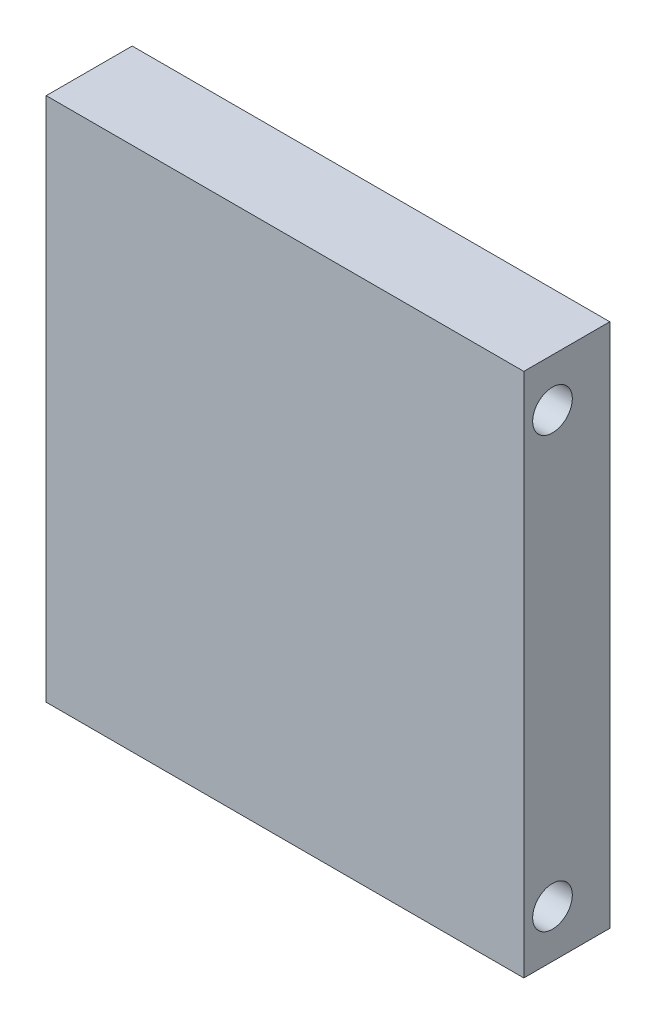
ISO-10303-21;
HEADER;
FILE_DESCRIPTION(('STEP AP214'),'2;1');
FILE_NAME('part.step','',(''),(''),'','','');
FILE_SCHEMA(('AUTOMOTIVE_DESIGN { 1 0 10303 214 1 1 1 1 }'));
ENDSEC;
DATA;
#1=APPLICATION_CONTEXT('core data for automotive mechanical design processes');
#2=APPLICATION_PROTOCOL_DEFINITION('international standard','automotive_design',2000,#1);
#3=PRODUCT_CONTEXT('',#1,'mechanical');
#4=PRODUCT('Part','Part','',(#3));
#5=PRODUCT_RELATED_PRODUCT_CATEGORY('part','',(#4));
#6=PRODUCT_DEFINITION_FORMATION('','',#4);
#7=PRODUCT_DEFINITION_CONTEXT('part definition',#1,'design');
#8=PRODUCT_DEFINITION('design','',#6,#7);
#9=PRODUCT_DEFINITION_SHAPE('','',#8);
#10=(LENGTH_UNIT() NAMED_UNIT(*) SI_UNIT(.MILLI.,.METRE.));
#11=(NAMED_UNIT(*) PLANE_ANGLE_UNIT() SI_UNIT($,.RADIAN.));
#12=(NAMED_UNIT(*) SI_UNIT($,.STERADIAN.) SOLID_ANGLE_UNIT());
#13=UNCERTAINTY_MEASURE_WITH_UNIT(LENGTH_MEASURE(1.E-05),#10,'distance_accuracy_value','');
#14=(GEOMETRIC_REPRESENTATION_CONTEXT(3) GLOBAL_UNCERTAINTY_ASSIGNED_CONTEXT((#13)) GLOBAL_UNIT_ASSIGNED_CONTEXT((#10,
#11,#12)) REPRESENTATION_CONTEXT('',''));
#15=CARTESIAN_POINT('',(0.,0.,0.));
#16=DIRECTION('',(0.,0.,1.));
#17=DIRECTION('',(1.,0.,0.));
#18=AXIS2_PLACEMENT_3D('',#15,#16,#17);
#19=CARTESIAN_POINT('',(0.,0.,0.));
#20=DIRECTION('',(0.,0.,1.));
#21=DIRECTION('',(1.,0.,0.));
#22=AXIS2_PLACEMENT_3D('',#19,#20,#21);
#23=PLANE('',#22);
#24=DIRECTION('',(1.,0.,0.));
#25=VECTOR('',#24,1.);
#26=CARTESIAN_POINT('',(16.0000000000001,34.,0.));
#27=LINE('',#26,#25);
#28=CARTESIAN_POINT('',(16.0000000000001,34.,0.));
#29=VERTEX_POINT('',#28);
#30=CARTESIAN_POINT('',(34.,34.,0.));
#31=VERTEX_POINT('',#30);
#32=EDGE_CURVE('E191',#29,#31,#27,.T.);
#33=ORIENTED_EDGE('',*,*,#32,.F.);
#34=DIRECTION('',(0.,1.,0.));
#35=VECTOR('',#34,1.);
#36=CARTESIAN_POINT('',(16.,16.,0.));
#37=LINE('',#36,#35);
#38=CARTESIAN_POINT('',(16.,16.,0.));
#39=VERTEX_POINT('',#38);
#40=EDGE_CURVE('E204',#39,#29,#37,.T.);
#41=ORIENTED_EDGE('',*,*,#40,.F.);
#42=DIRECTION('',(-1.,0.,0.));
#43=VECTOR('',#42,1.);
#44=CARTESIAN_POINT('',(34.,16.,0.));
#45=LINE('',#44,#43);
#46=CARTESIAN_POINT('',(34.,16.,0.));
#47=VERTEX_POINT('',#46);
#48=EDGE_CURVE('E213',#47,#39,#45,.T.);
#49=ORIENTED_EDGE('',*,*,#48,.F.);
#50=DIRECTION('',(0.,-1.,0.));
#51=VECTOR('',#50,1.);
#52=CARTESIAN_POINT('',(34.,34.,0.));
#53=LINE('',#52,#51);
#54=EDGE_CURVE('E194',#31,#47,#53,.T.);
#55=ORIENTED_EDGE('',*,*,#54,.F.);
#56=EDGE_LOOP('',(#33,#41,#49,#55));
#57=FACE_BOUND('',#56,.T.);
#58=DIRECTION('',(1.,0.,0.));
#59=VECTOR('',#58,1.);
#60=CARTESIAN_POINT('',(-34.,-16.,0.));
#61=LINE('',#60,#59);
#62=CARTESIAN_POINT('',(-34.,-16.,0.));
#63=VERTEX_POINT('',#62);
#64=CARTESIAN_POINT('',(-16.,-16.,0.));
#65=VERTEX_POINT('',#64);
#66=EDGE_CURVE('E262',#63,#65,#61,.T.);
#67=ORIENTED_EDGE('',*,*,#66,.F.);
#68=DIRECTION('',(0.,1.,0.));
#69=VECTOR('',#68,1.);
#70=CARTESIAN_POINT('',(-34.,-34.,0.));
#71=LINE('',#70,#69);
#72=CARTESIAN_POINT('',(-34.,-34.,0.));
#73=VERTEX_POINT('',#72);
#74=EDGE_CURVE('E267',#73,#63,#71,.T.);
#75=ORIENTED_EDGE('',*,*,#74,.F.);
#76=DIRECTION('',(-1.,0.,0.));
#77=VECTOR('',#76,1.);
#78=CARTESIAN_POINT('',(-16.,-34.,0.));
#79=LINE('',#78,#77);
#80=CARTESIAN_POINT('',(-16.,-34.,0.));
#81=VERTEX_POINT('',#80);
#82=EDGE_CURVE('E279',#81,#73,#79,.T.);
#83=ORIENTED_EDGE('',*,*,#82,.F.);
#84=DIRECTION('',(0.,-1.,0.));
#85=VECTOR('',#84,1.);
#86=CARTESIAN_POINT('',(-16.,-16.,0.));
#87=LINE('',#86,#85);
#88=EDGE_CURVE('E276',#65,#81,#87,.T.);
#89=ORIENTED_EDGE('',*,*,#88,.F.);
#90=EDGE_LOOP('',(#67,#75,#83,#89));
#91=FACE_BOUND('',#90,.T.);
#92=DIRECTION('',(0.,-1.,0.));
#93=VECTOR('',#92,1.);
#94=CARTESIAN_POINT('',(-50.,55.,0.));
#95=LINE('',#94,#93);
#96=CARTESIAN_POINT('',(-50.,55.,0.));
#97=VERTEX_POINT('',#96);
#98=CARTESIAN_POINT('',(-50.,-55.,0.));
#99=VERTEX_POINT('',#98);
#100=EDGE_CURVE('E295',#97,#99,#95,.T.);
#101=ORIENTED_EDGE('',*,*,#100,.F.);
#102=DIRECTION('',(-1.,0.,0.));
#103=VECTOR('',#102,1.);
#104=CARTESIAN_POINT('',(-50.,55.,0.));
#105=LINE('',#104,#103);
#106=CARTESIAN_POINT('',(50.,55.,0.));
#107=VERTEX_POINT('',#106);
#108=EDGE_CURVE('E300',#107,#97,#105,.T.);
#109=ORIENTED_EDGE('',*,*,#108,.F.);
#110=DIRECTION('',(0.,1.,0.));
#111=VECTOR('',#110,1.);
#112=CARTESIAN_POINT('',(50.,55.,0.));
#113=LINE('',#112,#111);
#114=CARTESIAN_POINT('',(50.,-55.,0.));
#115=VERTEX_POINT('',#114);
#116=EDGE_CURVE('E311',#115,#107,#113,.T.);
#117=ORIENTED_EDGE('',*,*,#116,.F.);
#118=DIRECTION('',(1.,0.,0.));
#119=VECTOR('',#118,1.);
#120=CARTESIAN_POINT('',(-50.,-55.,0.));
#121=LINE('',#120,#119);
#122=EDGE_CURVE('E309',#99,#115,#121,.T.);
#123=ORIENTED_EDGE('',*,*,#122,.F.);
#124=EDGE_LOOP('',(#101,#109,#117,#123));
#125=FACE_BOUND('',#124,.T.);
#126=DIRECTION('',(0.,-1.,0.));
#127=VECTOR('',#126,1.);
#128=CARTESIAN_POINT('',(34.,-34.,0.));
#129=LINE('',#128,#127);
#130=CARTESIAN_POINT('',(34.,-16.,0.));
#131=VERTEX_POINT('',#130);
#132=CARTESIAN_POINT('',(34.,-34.,0.));
#133=VERTEX_POINT('',#132);
#134=EDGE_CURVE('E229',#131,#133,#129,.T.);
#135=ORIENTED_EDGE('',*,*,#134,.F.);
#136=DIRECTION('',(1.,0.,0.));
#137=VECTOR('',#136,1.);
#138=CARTESIAN_POINT('',(34.,-16.,0.));
#139=LINE('',#138,#137);
#140=CARTESIAN_POINT('',(16.,-16.,0.));
#141=VERTEX_POINT('',#140);
#142=EDGE_CURVE('E234',#141,#131,#139,.T.);
#143=ORIENTED_EDGE('',*,*,#142,.F.);
#144=DIRECTION('',(0.,1.,0.));
#145=VECTOR('',#144,1.);
#146=CARTESIAN_POINT('',(16.,-16.,0.));
#147=LINE('',#146,#145);
#148=CARTESIAN_POINT('',(16.0000000000001,-34.,0.));
#149=VERTEX_POINT('',#148);
#150=EDGE_CURVE('E246',#149,#141,#147,.T.);
#151=ORIENTED_EDGE('',*,*,#150,.F.);
#152=DIRECTION('',(-1.,0.,0.));
#153=VECTOR('',#152,1.);
#154=CARTESIAN_POINT('',(16.0000000000001,-34.,0.));
#155=LINE('',#154,#153);
#156=EDGE_CURVE('E243',#133,#149,#155,.T.);
#157=ORIENTED_EDGE('',*,*,#156,.F.);
#158=EDGE_LOOP('',(#135,#143,#151,#157));
#159=FACE_BOUND('',#158,.T.);
#160=DIRECTION('',(0.,1.,0.));
#161=VECTOR('',#160,1.);
#162=CARTESIAN_POINT('',(-34.,34.,0.));
#163=LINE('',#162,#161);
#164=CARTESIAN_POINT('',(-34.,16.,0.));
#165=VERTEX_POINT('',#164);
#166=CARTESIAN_POINT('',(-34.,34.,0.));
#167=VERTEX_POINT('',#166);
#168=EDGE_CURVE('E190',#165,#167,#163,.T.);
#169=ORIENTED_EDGE('',*,*,#168,.F.);
#170=DIRECTION('',(-1.,0.,0.));
#171=VECTOR('',#170,1.);
#172=CARTESIAN_POINT('',(-34.,16.,0.));
#173=LINE('',#172,#171);
#174=CARTESIAN_POINT('',(-16.,16.,0.));
#175=VERTEX_POINT('',#174);
#176=EDGE_CURVE('E187',#175,#165,#173,.T.);
#177=ORIENTED_EDGE('',*,*,#176,.F.);
#178=DIRECTION('',(0.,-1.,0.));
#179=VECTOR('',#178,1.);
#180=CARTESIAN_POINT('',(-16.,16.,0.));
#181=LINE('',#180,#179);
#182=CARTESIAN_POINT('',(-16.,34.,0.));
#183=VERTEX_POINT('',#182);
#184=EDGE_CURVE('E53',#183,#175,#181,.T.);
#185=ORIENTED_EDGE('',*,*,#184,.F.);
#186=DIRECTION('',(1.,0.,0.));
#187=VECTOR('',#186,1.);
#188=CARTESIAN_POINT('',(-16.,34.,0.));
#189=LINE('',#188,#187);
#190=EDGE_CURVE('E48',#167,#183,#189,.T.);
#191=ORIENTED_EDGE('',*,*,#190,.F.);
#192=EDGE_LOOP('',(#169,#177,#185,#191));
#193=FACE_BOUND('',#192,.T.);
#194=ADVANCED_FACE('F33',(#57,#91,#125,#159,#193),#23,.F.);
#195=CARTESIAN_POINT('',(-50.,55.,18.));
#196=DIRECTION('',(1.,0.,0.));
#197=DIRECTION('',(0.,0.,-1.));
#198=AXIS2_PLACEMENT_3D('',#195,#196,#197);
#199=PLANE('',#198);
#200=CARTESIAN_POINT('',(-50.,44.9999999999204,12.));
#201=DIRECTION('',(-1.,0.,0.));
#202=DIRECTION('',(0.,0.,1.));
#203=AXIS2_PLACEMENT_3D('',#200,#201,#202);
#204=CIRCLE('',#203,4.15000000000372);
#205=CARTESIAN_POINT('',(-50.,44.9999999999204,16.1500000000037));
#206=VERTEX_POINT('',#205);
#207=EDGE_CURVE('E454',#206,#206,#204,.T.);
#208=ORIENTED_EDGE('',*,*,#207,.F.);
#209=EDGE_LOOP('',(#208));
#210=FACE_BOUND('',#209,.T.);
#211=CARTESIAN_POINT('',(-50.,-45.0000000000802,12.));
#212=DIRECTION('',(-1.,0.,0.));
#213=DIRECTION('',(0.,0.,1.));
#214=AXIS2_PLACEMENT_3D('',#211,#212,#213);
#215=CIRCLE('',#214,4.15000000000372);
#216=CARTESIAN_POINT('',(-50.,-45.0000000000802,16.1500000000037));
#217=VERTEX_POINT('',#216);
#218=EDGE_CURVE('E459',#217,#217,#215,.T.);
#219=ORIENTED_EDGE('',*,*,#218,.F.);
#220=EDGE_LOOP('',(#219));
#221=FACE_BOUND('',#220,.T.);
#222=ORIENTED_EDGE('',*,*,#100,.T.);
#223=DIRECTION('',(0.,0.,-1.));
#224=VECTOR('',#223,1.);
#225=CARTESIAN_POINT('',(-50.,-55.,18.));
#226=LINE('',#225,#224);
#227=CARTESIAN_POINT('',(-50.,-55.,18.));
#228=VERTEX_POINT('',#227);
#229=EDGE_CURVE('E11',#228,#99,#226,.T.);
#230=ORIENTED_EDGE('',*,*,#229,.F.);
#231=DIRECTION('',(0.,-1.,0.));
#232=VECTOR('',#231,1.);
#233=CARTESIAN_POINT('',(-50.,55.,18.));
#234=LINE('',#233,#232);
#235=CARTESIAN_POINT('',(-50.,55.,18.));
#236=VERTEX_POINT('',#235);
#237=EDGE_CURVE('E296',#236,#228,#234,.T.);
#238=ORIENTED_EDGE('',*,*,#237,.F.);
#239=DIRECTION('',(0.,0.,-1.));
#240=VECTOR('',#239,1.);
#241=CARTESIAN_POINT('',(-50.,55.,18.));
#242=LINE('',#241,#240);
#243=EDGE_CURVE('E306',#236,#97,#242,.T.);
#244=ORIENTED_EDGE('',*,*,#243,.T.);
#245=EDGE_LOOP('',(#222,#230,#238,#244));
#246=FACE_BOUND('',#245,.T.);
#247=ADVANCED_FACE('F35',(#210,#221,#246),#199,.F.);
#248=CARTESIAN_POINT('',(-50.,-55.,18.));
#249=DIRECTION('',(0.,1.,0.));
#250=DIRECTION('',(0.,0.,1.));
#251=AXIS2_PLACEMENT_3D('',#248,#249,#250);
#252=PLANE('',#251);
#253=ORIENTED_EDGE('',*,*,#122,.T.);
#254=DIRECTION('',(0.,0.,-1.));
#255=VECTOR('',#254,1.);
#256=CARTESIAN_POINT('',(50.,-55.,18.));
#257=LINE('',#256,#255);
#258=CARTESIAN_POINT('',(50.,-55.,18.));
#259=VERTEX_POINT('',#258);
#260=EDGE_CURVE('E41',#259,#115,#257,.T.);
#261=ORIENTED_EDGE('',*,*,#260,.F.);
#262=DIRECTION('',(1.,0.,0.));
#263=VECTOR('',#262,1.);
#264=CARTESIAN_POINT('',(-50.,-55.,18.));
#265=LINE('',#264,#263);
#266=EDGE_CURVE('E299',#228,#259,#265,.T.);
#267=ORIENTED_EDGE('',*,*,#266,.F.);
#268=ORIENTED_EDGE('',*,*,#229,.T.);
#269=EDGE_LOOP('',(#253,#261,#267,#268));
#270=FACE_BOUND('',#269,.T.);
#271=ADVANCED_FACE('F339',(#270),#252,.F.);
#272=CARTESIAN_POINT('',(50.,55.,18.));
#273=DIRECTION('',(-1.,0.,0.));
#274=DIRECTION('',(0.,0.,1.));
#275=AXIS2_PLACEMENT_3D('',#272,#273,#274);
#276=PLANE('',#275);
#277=CARTESIAN_POINT('',(50.,44.9999999999204,12.));
#278=DIRECTION('',(-1.,0.,0.));
#279=DIRECTION('',(0.,0.,1.));
#280=AXIS2_PLACEMENT_3D('',#277,#278,#279);
#281=CIRCLE('',#280,4.15000000000372);
#282=CARTESIAN_POINT('',(50.,44.9999999999204,16.1500000000037));
#283=VERTEX_POINT('',#282);
#284=EDGE_CURVE('E451',#283,#283,#281,.T.);
#285=ORIENTED_EDGE('',*,*,#284,.T.);
#286=EDGE_LOOP('',(#285));
#287=FACE_BOUND('',#286,.T.);
#288=CARTESIAN_POINT('',(50.,-45.0000000000802,12.));
#289=DIRECTION('',(-1.,0.,0.));
#290=DIRECTION('',(0.,0.,1.));
#291=AXIS2_PLACEMENT_3D('',#288,#289,#290);
#292=CIRCLE('',#291,4.15000000000372);
#293=CARTESIAN_POINT('',(50.,-45.0000000000802,16.1500000000037));
#294=VERTEX_POINT('',#293);
#295=EDGE_CURVE('E455',#294,#294,#292,.T.);
#296=ORIENTED_EDGE('',*,*,#295,.T.);
#297=EDGE_LOOP('',(#296));
#298=FACE_BOUND('',#297,.T.);
#299=ORIENTED_EDGE('',*,*,#116,.T.);
#300=DIRECTION('',(0.,0.,-1.));
#301=VECTOR('',#300,1.);
#302=CARTESIAN_POINT('',(50.,55.,18.));
#303=LINE('',#302,#301);
#304=CARTESIAN_POINT('',(50.,55.,18.));
#305=VERTEX_POINT('',#304);
#306=EDGE_CURVE('E316',#305,#107,#303,.T.);
#307=ORIENTED_EDGE('',*,*,#306,.F.);
#308=DIRECTION('',(0.,1.,0.));
#309=VECTOR('',#308,1.);
#310=CARTESIAN_POINT('',(50.,55.,18.));
#311=LINE('',#310,#309);
#312=EDGE_CURVE('E302',#259,#305,#311,.T.);
#313=ORIENTED_EDGE('',*,*,#312,.F.);
#314=ORIENTED_EDGE('',*,*,#260,.T.);
#315=EDGE_LOOP('',(#299,#307,#313,#314));
#316=FACE_BOUND('',#315,.T.);
#317=ADVANCED_FACE('F323',(#287,#298,#316),#276,.F.);
#318=CARTESIAN_POINT('',(-50.,55.,18.));
#319=DIRECTION('',(0.,-1.,0.));
#320=DIRECTION('',(0.,0.,-1.));
#321=AXIS2_PLACEMENT_3D('',#318,#319,#320);
#322=PLANE('',#321);
#323=ORIENTED_EDGE('',*,*,#108,.T.);
#324=ORIENTED_EDGE('',*,*,#243,.F.);
#325=DIRECTION('',(-1.,0.,0.));
#326=VECTOR('',#325,1.);
#327=CARTESIAN_POINT('',(-50.,55.,18.));
#328=LINE('',#327,#326);
#329=EDGE_CURVE('E304',#305,#236,#328,.T.);
#330=ORIENTED_EDGE('',*,*,#329,.F.);
#331=ORIENTED_EDGE('',*,*,#306,.T.);
#332=EDGE_LOOP('',(#323,#324,#330,#331));
#333=FACE_BOUND('',#332,.T.);
#334=ADVANCED_FACE('F332',(#333),#322,.F.);
#335=CARTESIAN_POINT('',(0.,0.,18.));
#336=DIRECTION('',(0.,0.,1.));
#337=DIRECTION('',(1.,0.,0.));
#338=AXIS2_PLACEMENT_3D('',#335,#336,#337);
#339=PLANE('',#338);
#340=ORIENTED_EDGE('',*,*,#237,.T.);
#341=ORIENTED_EDGE('',*,*,#266,.T.);
#342=ORIENTED_EDGE('',*,*,#312,.T.);
#343=ORIENTED_EDGE('',*,*,#329,.T.);
#344=EDGE_LOOP('',(#340,#341,#342,#343));
#345=FACE_BOUND('',#344,.T.);
#346=ADVANCED_FACE('F338',(#345),#339,.T.);
#347=CARTESIAN_POINT('',(-34.,-16.,-10.));
#348=DIRECTION('',(0.,-1.,0.));
#349=DIRECTION('',(0.,0.,-1.));
#350=AXIS2_PLACEMENT_3D('',#347,#348,#349);
#351=PLANE('',#350);
#352=ORIENTED_EDGE('',*,*,#66,.T.);
#353=DIRECTION('',(0.,0.,1.));
#354=VECTOR('',#353,1.);
#355=CARTESIAN_POINT('',(-16.,-16.,-10.));
#356=LINE('',#355,#354);
#357=CARTESIAN_POINT('',(-16.,-16.,-10.));
#358=VERTEX_POINT('',#357);
#359=EDGE_CURVE('E292',#358,#65,#356,.T.);
#360=ORIENTED_EDGE('',*,*,#359,.F.);
#361=DIRECTION('',(1.,0.,0.));
#362=VECTOR('',#361,1.);
#363=CARTESIAN_POINT('',(-34.,-16.,-10.));
#364=LINE('',#363,#362);
#365=CARTESIAN_POINT('',(-34.,-16.,-10.));
#366=VERTEX_POINT('',#365);
#367=EDGE_CURVE('E263',#366,#358,#364,.T.);
#368=ORIENTED_EDGE('',*,*,#367,.F.);
#369=DIRECTION('',(0.,0.,1.));
#370=VECTOR('',#369,1.);
#371=CARTESIAN_POINT('',(-34.,-16.,-10.));
#372=LINE('',#371,#370);
#373=EDGE_CURVE('E273',#366,#63,#372,.T.);
#374=ORIENTED_EDGE('',*,*,#373,.T.);
#375=EDGE_LOOP('',(#352,#360,#368,#374));
#376=FACE_BOUND('',#375,.T.);
#377=ADVANCED_FACE('F361',(#376),#351,.F.);
#378=CARTESIAN_POINT('',(-16.,-16.,-10.));
#379=DIRECTION('',(-1.,0.,0.));
#380=DIRECTION('',(0.,0.,1.));
#381=AXIS2_PLACEMENT_3D('',#378,#379,#380);
#382=PLANE('',#381);
#383=ORIENTED_EDGE('',*,*,#88,.T.);
#384=DIRECTION('',(0.,0.,1.));
#385=VECTOR('',#384,1.);
#386=CARTESIAN_POINT('',(-16.,-34.,-10.));
#387=LINE('',#386,#385);
#388=CARTESIAN_POINT('',(-16.,-34.,-10.));
#389=VERTEX_POINT('',#388);
#390=EDGE_CURVE('E289',#389,#81,#387,.T.);
#391=ORIENTED_EDGE('',*,*,#390,.F.);
#392=DIRECTION('',(0.,-1.,0.));
#393=VECTOR('',#392,1.);
#394=CARTESIAN_POINT('',(-16.,-16.,-10.));
#395=LINE('',#394,#393);
#396=EDGE_CURVE('E266',#358,#389,#395,.T.);
#397=ORIENTED_EDGE('',*,*,#396,.F.);
#398=ORIENTED_EDGE('',*,*,#359,.T.);
#399=EDGE_LOOP('',(#383,#391,#397,#398));
#400=FACE_BOUND('',#399,.T.);
#401=ADVANCED_FACE('F365',(#400),#382,.F.);
#402=CARTESIAN_POINT('',(-16.,-34.,-10.));
#403=DIRECTION('',(0.,1.,0.));
#404=DIRECTION('',(0.,0.,1.));
#405=AXIS2_PLACEMENT_3D('',#402,#403,#404);
#406=PLANE('',#405);
#407=ORIENTED_EDGE('',*,*,#82,.T.);
#408=DIRECTION('',(0.,0.,1.));
#409=VECTOR('',#408,1.);
#410=CARTESIAN_POINT('',(-34.,-34.,-10.));
#411=LINE('',#410,#409);
#412=CARTESIAN_POINT('',(-34.,-34.,-10.));
#413=VERTEX_POINT('',#412);
#414=EDGE_CURVE('E286',#413,#73,#411,.T.);
#415=ORIENTED_EDGE('',*,*,#414,.F.);
#416=DIRECTION('',(-1.,0.,0.));
#417=VECTOR('',#416,1.);
#418=CARTESIAN_POINT('',(-16.,-34.,-10.));
#419=LINE('',#418,#417);
#420=EDGE_CURVE('E269',#389,#413,#419,.T.);
#421=ORIENTED_EDGE('',*,*,#420,.F.);
#422=ORIENTED_EDGE('',*,*,#390,.T.);
#423=EDGE_LOOP('',(#407,#415,#421,#422));
#424=FACE_BOUND('',#423,.T.);
#425=ADVANCED_FACE('F370',(#424),#406,.F.);
#426=CARTESIAN_POINT('',(-34.,-34.,-10.));
#427=DIRECTION('',(1.,0.,0.));
#428=DIRECTION('',(0.,0.,-1.));
#429=AXIS2_PLACEMENT_3D('',#426,#427,#428);
#430=PLANE('',#429);
#431=ORIENTED_EDGE('',*,*,#74,.T.);
#432=ORIENTED_EDGE('',*,*,#373,.F.);
#433=DIRECTION('',(0.,1.,0.));
#434=VECTOR('',#433,1.);
#435=CARTESIAN_POINT('',(-34.,-34.,-10.));
#436=LINE('',#435,#434);
#437=EDGE_CURVE('E271',#413,#366,#436,.T.);
#438=ORIENTED_EDGE('',*,*,#437,.F.);
#439=ORIENTED_EDGE('',*,*,#414,.T.);
#440=EDGE_LOOP('',(#431,#432,#438,#439));
#441=FACE_BOUND('',#440,.T.);
#442=ADVANCED_FACE('F376',(#441),#430,.F.);
#443=CARTESIAN_POINT('',(0.,0.,-10.));
#444=DIRECTION('',(0.,0.,-1.));
#445=DIRECTION('',(-1.,0.,0.));
#446=AXIS2_PLACEMENT_3D('',#443,#444,#445);
#447=PLANE('',#446);
#448=ORIENTED_EDGE('',*,*,#367,.T.);
#449=ORIENTED_EDGE('',*,*,#396,.T.);
#450=ORIENTED_EDGE('',*,*,#420,.T.);
#451=ORIENTED_EDGE('',*,*,#437,.T.);
#452=EDGE_LOOP('',(#448,#449,#450,#451));
#453=FACE_BOUND('',#452,.T.);
#454=ADVANCED_FACE('F380',(#453),#447,.T.);
#455=CARTESIAN_POINT('',(34.,-34.,-10.));
#456=DIRECTION('',(-1.,0.,0.));
#457=DIRECTION('',(0.,0.,1.));
#458=AXIS2_PLACEMENT_3D('',#455,#456,#457);
#459=PLANE('',#458);
#460=ORIENTED_EDGE('',*,*,#134,.T.);
#461=DIRECTION('',(0.,0.,1.));
#462=VECTOR('',#461,1.);
#463=CARTESIAN_POINT('',(34.,-34.,-10.));
#464=LINE('',#463,#462);
#465=CARTESIAN_POINT('',(34.,-34.,-10.));
#466=VERTEX_POINT('',#465);
#467=EDGE_CURVE('E259',#466,#133,#464,.T.);
#468=ORIENTED_EDGE('',*,*,#467,.F.);
#469=DIRECTION('',(0.,-1.,0.));
#470=VECTOR('',#469,1.);
#471=CARTESIAN_POINT('',(34.,-34.,-10.));
#472=LINE('',#471,#470);
#473=CARTESIAN_POINT('',(34.,-16.,-10.));
#474=VERTEX_POINT('',#473);
#475=EDGE_CURVE('E230',#474,#466,#472,.T.);
#476=ORIENTED_EDGE('',*,*,#475,.F.);
#477=DIRECTION('',(0.,0.,1.));
#478=VECTOR('',#477,1.);
#479=CARTESIAN_POINT('',(34.,-16.,-10.));
#480=LINE('',#479,#478);
#481=EDGE_CURVE('E240',#474,#131,#480,.T.);
#482=ORIENTED_EDGE('',*,*,#481,.T.);
#483=EDGE_LOOP('',(#460,#468,#476,#482));
#484=FACE_BOUND('',#483,.T.);
#485=ADVANCED_FACE('F384',(#484),#459,.F.);
#486=CARTESIAN_POINT('',(16.0000000000001,-34.,-10.));
#487=DIRECTION('',(0.,1.,0.));
#488=DIRECTION('',(-1.,0.,0.));
#489=AXIS2_PLACEMENT_3D('',#486,#487,#488);
#490=PLANE('',#489);
#491=ORIENTED_EDGE('',*,*,#156,.T.);
#492=DIRECTION('',(0.,0.,1.));
#493=VECTOR('',#492,1.);
#494=CARTESIAN_POINT('',(16.0000000000001,-34.,-10.));
#495=LINE('',#494,#493);
#496=CARTESIAN_POINT('',(16.0000000000001,-34.,-10.));
#497=VERTEX_POINT('',#496);
#498=EDGE_CURVE('E256',#497,#149,#495,.T.);
#499=ORIENTED_EDGE('',*,*,#498,.F.);
#500=DIRECTION('',(-1.,0.,0.));
#501=VECTOR('',#500,1.);
#502=CARTESIAN_POINT('',(16.0000000000001,-34.,-10.));
#503=LINE('',#502,#501);
#504=EDGE_CURVE('E233',#466,#497,#503,.T.);
#505=ORIENTED_EDGE('',*,*,#504,.F.);
#506=ORIENTED_EDGE('',*,*,#467,.T.);
#507=EDGE_LOOP('',(#491,#499,#505,#506));
#508=FACE_BOUND('',#507,.T.);
#509=ADVANCED_FACE('F388',(#508),#490,.F.);
#510=CARTESIAN_POINT('',(16.,-16.,-10.));
#511=DIRECTION('',(1.,0.,0.));
#512=DIRECTION('',(0.,1.,0.));
#513=AXIS2_PLACEMENT_3D('',#510,#511,#512);
#514=PLANE('',#513);
#515=ORIENTED_EDGE('',*,*,#150,.T.);
#516=DIRECTION('',(0.,0.,1.));
#517=VECTOR('',#516,1.);
#518=CARTESIAN_POINT('',(16.,-16.,-10.));
#519=LINE('',#518,#517);
#520=CARTESIAN_POINT('',(16.,-16.,-10.));
#521=VERTEX_POINT('',#520);
#522=EDGE_CURVE('E253',#521,#141,#519,.T.);
#523=ORIENTED_EDGE('',*,*,#522,.F.);
#524=DIRECTION('',(0.,1.,0.));
#525=VECTOR('',#524,1.);
#526=CARTESIAN_POINT('',(16.,-16.,-10.));
#527=LINE('',#526,#525);
#528=EDGE_CURVE('E236',#497,#521,#527,.T.);
#529=ORIENTED_EDGE('',*,*,#528,.F.);
#530=ORIENTED_EDGE('',*,*,#498,.T.);
#531=EDGE_LOOP('',(#515,#523,#529,#530));
#532=FACE_BOUND('',#531,.T.);
#533=ADVANCED_FACE('F392',(#532),#514,.F.);
#534=CARTESIAN_POINT('',(34.,-16.,-10.));
#535=DIRECTION('',(0.,-1.,0.));
#536=DIRECTION('',(1.,0.,0.));
#537=AXIS2_PLACEMENT_3D('',#534,#535,#536);
#538=PLANE('',#537);
#539=ORIENTED_EDGE('',*,*,#142,.T.);
#540=ORIENTED_EDGE('',*,*,#481,.F.);
#541=DIRECTION('',(1.,0.,0.));
#542=VECTOR('',#541,1.);
#543=CARTESIAN_POINT('',(34.,-16.,-10.));
#544=LINE('',#543,#542);
#545=EDGE_CURVE('E238',#521,#474,#544,.T.);
#546=ORIENTED_EDGE('',*,*,#545,.F.);
#547=ORIENTED_EDGE('',*,*,#522,.T.);
#548=EDGE_LOOP('',(#539,#540,#546,#547));
#549=FACE_BOUND('',#548,.T.);
#550=ADVANCED_FACE('F396',(#549),#538,.F.);
#551=CARTESIAN_POINT('',(0.,0.,-10.));
#552=DIRECTION('',(0.,0.,1.));
#553=DIRECTION('',(1.,0.,0.));
#554=AXIS2_PLACEMENT_3D('',#551,#552,#553);
#555=PLANE('',#554);
#556=ORIENTED_EDGE('',*,*,#475,.T.);
#557=ORIENTED_EDGE('',*,*,#504,.T.);
#558=ORIENTED_EDGE('',*,*,#528,.T.);
#559=ORIENTED_EDGE('',*,*,#545,.T.);
#560=EDGE_LOOP('',(#556,#557,#558,#559));
#561=FACE_BOUND('',#560,.T.);
#562=ADVANCED_FACE('F400',(#561),#555,.F.);
#563=CARTESIAN_POINT('',(16.0000000000001,34.,-10.));
#564=DIRECTION('',(0.,-1.,0.));
#565=DIRECTION('',(1.,0.,0.));
#566=AXIS2_PLACEMENT_3D('',#563,#564,#565);
#567=PLANE('',#566);
#568=ORIENTED_EDGE('',*,*,#32,.T.);
#569=DIRECTION('',(0.,0.,1.));
#570=VECTOR('',#569,1.);
#571=CARTESIAN_POINT('',(34.,34.,-10.));
#572=LINE('',#571,#570);
#573=CARTESIAN_POINT('',(34.,34.,-10.));
#574=VERTEX_POINT('',#573);
#575=EDGE_CURVE('E226',#574,#31,#572,.T.);
#576=ORIENTED_EDGE('',*,*,#575,.F.);
#577=DIRECTION('',(1.,0.,0.));
#578=VECTOR('',#577,1.);
#579=CARTESIAN_POINT('',(16.0000000000001,34.,-10.));
#580=LINE('',#579,#578);
#581=CARTESIAN_POINT('',(16.0000000000001,34.,-10.));
#582=VERTEX_POINT('',#581);
#583=EDGE_CURVE('E200',#582,#574,#580,.T.);
#584=ORIENTED_EDGE('',*,*,#583,.F.);
#585=DIRECTION('',(0.,0.,1.));
#586=VECTOR('',#585,1.);
#587=CARTESIAN_POINT('',(16.0000000000001,34.,-10.));
#588=LINE('',#587,#586);
#589=EDGE_CURVE('E209',#582,#29,#588,.T.);
#590=ORIENTED_EDGE('',*,*,#589,.T.);
#591=EDGE_LOOP('',(#568,#576,#584,#590));
#592=FACE_BOUND('',#591,.T.);
#593=ADVANCED_FACE('F404',(#592),#567,.F.);
#594=CARTESIAN_POINT('',(34.,34.,-10.));
#595=DIRECTION('',(-1.,0.,0.));
#596=DIRECTION('',(0.,0.,1.));
#597=AXIS2_PLACEMENT_3D('',#594,#595,#596);
#598=PLANE('',#597);
#599=ORIENTED_EDGE('',*,*,#54,.T.);
#600=DIRECTION('',(0.,0.,1.));
#601=VECTOR('',#600,1.);
#602=CARTESIAN_POINT('',(34.,16.,-10.));
#603=LINE('',#602,#601);
#604=CARTESIAN_POINT('',(34.,16.,-10.));
#605=VERTEX_POINT('',#604);
#606=EDGE_CURVE('E223',#605,#47,#603,.T.);
#607=ORIENTED_EDGE('',*,*,#606,.F.);
#608=DIRECTION('',(0.,-1.,0.));
#609=VECTOR('',#608,1.);
#610=CARTESIAN_POINT('',(34.,34.,-10.));
#611=LINE('',#610,#609);
#612=EDGE_CURVE('E203',#574,#605,#611,.T.);
#613=ORIENTED_EDGE('',*,*,#612,.F.);
#614=ORIENTED_EDGE('',*,*,#575,.T.);
#615=EDGE_LOOP('',(#599,#607,#613,#614));
#616=FACE_BOUND('',#615,.T.);
#617=ADVANCED_FACE('F408',(#616),#598,.F.);
#618=CARTESIAN_POINT('',(34.,16.,-10.));
#619=DIRECTION('',(0.,1.,0.));
#620=DIRECTION('',(-1.,0.,0.));
#621=AXIS2_PLACEMENT_3D('',#618,#619,#620);
#622=PLANE('',#621);
#623=ORIENTED_EDGE('',*,*,#48,.T.);
#624=DIRECTION('',(0.,0.,1.));
#625=VECTOR('',#624,1.);
#626=CARTESIAN_POINT('',(16.,16.,-10.));
#627=LINE('',#626,#625);
#628=CARTESIAN_POINT('',(16.,16.,-10.));
#629=VERTEX_POINT('',#628);
#630=EDGE_CURVE('E220',#629,#39,#627,.T.);
#631=ORIENTED_EDGE('',*,*,#630,.F.);
#632=DIRECTION('',(-1.,0.,0.));
#633=VECTOR('',#632,1.);
#634=CARTESIAN_POINT('',(34.,16.,-10.));
#635=LINE('',#634,#633);
#636=EDGE_CURVE('E206',#605,#629,#635,.T.);
#637=ORIENTED_EDGE('',*,*,#636,.F.);
#638=ORIENTED_EDGE('',*,*,#606,.T.);
#639=EDGE_LOOP('',(#623,#631,#637,#638));
#640=FACE_BOUND('',#639,.T.);
#641=ADVANCED_FACE('F412',(#640),#622,.F.);
#642=CARTESIAN_POINT('',(16.,16.,-10.));
#643=DIRECTION('',(1.,0.,0.));
#644=DIRECTION('',(0.,1.,0.));
#645=AXIS2_PLACEMENT_3D('',#642,#643,#644);
#646=PLANE('',#645);
#647=ORIENTED_EDGE('',*,*,#40,.T.);
#648=ORIENTED_EDGE('',*,*,#589,.F.);
#649=DIRECTION('',(0.,1.,0.));
#650=VECTOR('',#649,1.);
#651=CARTESIAN_POINT('',(16.,16.,-10.));
#652=LINE('',#651,#650);
#653=EDGE_CURVE('E208',#629,#582,#652,.T.);
#654=ORIENTED_EDGE('',*,*,#653,.F.);
#655=ORIENTED_EDGE('',*,*,#630,.T.);
#656=EDGE_LOOP('',(#647,#648,#654,#655));
#657=FACE_BOUND('',#656,.T.);
#658=ADVANCED_FACE('F416',(#657),#646,.F.);
#659=CARTESIAN_POINT('',(0.,0.,-10.));
#660=DIRECTION('',(0.,0.,-1.));
#661=DIRECTION('',(-1.,0.,0.));
#662=AXIS2_PLACEMENT_3D('',#659,#660,#661);
#663=PLANE('',#662);
#664=ORIENTED_EDGE('',*,*,#583,.T.);
#665=ORIENTED_EDGE('',*,*,#612,.T.);
#666=ORIENTED_EDGE('',*,*,#636,.T.);
#667=ORIENTED_EDGE('',*,*,#653,.T.);
#668=EDGE_LOOP('',(#664,#665,#666,#667));
#669=FACE_BOUND('',#668,.T.);
#670=ADVANCED_FACE('F420',(#669),#663,.T.);
#671=CARTESIAN_POINT('',(-34.,34.,-10.));
#672=DIRECTION('',(1.,0.,0.));
#673=DIRECTION('',(0.,0.,-1.));
#674=AXIS2_PLACEMENT_3D('',#671,#672,#673);
#675=PLANE('',#674);
#676=ORIENTED_EDGE('',*,*,#168,.T.);
#677=DIRECTION('',(0.,0.,1.));
#678=VECTOR('',#677,1.);
#679=CARTESIAN_POINT('',(-34.,34.,-10.));
#680=LINE('',#679,#678);
#681=CARTESIAN_POINT('',(-34.,34.,-10.));
#682=VERTEX_POINT('',#681);
#683=EDGE_CURVE('E171',#682,#167,#680,.T.);
#684=ORIENTED_EDGE('',*,*,#683,.F.);
#685=DIRECTION('',(0.,1.,0.));
#686=VECTOR('',#685,1.);
#687=CARTESIAN_POINT('',(-34.,34.,-10.));
#688=LINE('',#687,#686);
#689=CARTESIAN_POINT('',(-34.,16.,-10.));
#690=VERTEX_POINT('',#689);
#691=EDGE_CURVE('E178',#690,#682,#688,.T.);
#692=ORIENTED_EDGE('',*,*,#691,.F.);
#693=DIRECTION('',(0.,0.,1.));
#694=VECTOR('',#693,1.);
#695=CARTESIAN_POINT('',(-34.,16.,-10.));
#696=LINE('',#695,#694);
#697=EDGE_CURVE('E466',#690,#165,#696,.T.);
#698=ORIENTED_EDGE('',*,*,#697,.T.);
#699=EDGE_LOOP('',(#676,#684,#692,#698));
#700=FACE_BOUND('',#699,.T.);
#701=ADVANCED_FACE('F189',(#700),#675,.F.);
#702=CARTESIAN_POINT('',(-16.,34.,-10.));
#703=DIRECTION('',(0.,-1.,0.));
#704=DIRECTION('',(0.,0.,-1.));
#705=AXIS2_PLACEMENT_3D('',#702,#703,#704);
#706=PLANE('',#705);
#707=ORIENTED_EDGE('',*,*,#190,.T.);
#708=DIRECTION('',(0.,0.,1.));
#709=VECTOR('',#708,1.);
#710=CARTESIAN_POINT('',(-16.,34.,-10.));
#711=LINE('',#710,#709);
#712=CARTESIAN_POINT('',(-16.,34.,-10.));
#713=VERTEX_POINT('',#712);
#714=EDGE_CURVE('E174',#713,#183,#711,.T.);
#715=ORIENTED_EDGE('',*,*,#714,.F.);
#716=DIRECTION('',(1.,0.,0.));
#717=VECTOR('',#716,1.);
#718=CARTESIAN_POINT('',(-16.,34.,-10.));
#719=LINE('',#718,#717);
#720=EDGE_CURVE('E167',#682,#713,#719,.T.);
#721=ORIENTED_EDGE('',*,*,#720,.F.);
#722=ORIENTED_EDGE('',*,*,#683,.T.);
#723=EDGE_LOOP('',(#707,#715,#721,#722));
#724=FACE_BOUND('',#723,.T.);
#725=ADVANCED_FACE('F169',(#724),#706,.F.);
#726=CARTESIAN_POINT('',(-16.,16.,-10.));
#727=DIRECTION('',(-1.,0.,0.));
#728=DIRECTION('',(0.,0.,1.));
#729=AXIS2_PLACEMENT_3D('',#726,#727,#728);
#730=PLANE('',#729);
#731=ORIENTED_EDGE('',*,*,#184,.T.);
#732=DIRECTION('',(0.,0.,1.));
#733=VECTOR('',#732,1.);
#734=CARTESIAN_POINT('',(-16.,16.,-10.));
#735=LINE('',#734,#733);
#736=CARTESIAN_POINT('',(-16.,16.,-10.));
#737=VERTEX_POINT('',#736);
#738=EDGE_CURVE('E196',#737,#175,#735,.T.);
#739=ORIENTED_EDGE('',*,*,#738,.F.);
#740=DIRECTION('',(0.,-1.,0.));
#741=VECTOR('',#740,1.);
#742=CARTESIAN_POINT('',(-16.,16.,-10.));
#743=LINE('',#742,#741);
#744=EDGE_CURVE('E177',#713,#737,#743,.T.);
#745=ORIENTED_EDGE('',*,*,#744,.F.);
#746=ORIENTED_EDGE('',*,*,#714,.T.);
#747=EDGE_LOOP('',(#731,#739,#745,#746));
#748=FACE_BOUND('',#747,.T.);
#749=ADVANCED_FACE('F429',(#748),#730,.F.);
#750=CARTESIAN_POINT('',(-34.,16.,-10.));
#751=DIRECTION('',(0.,1.,0.));
#752=DIRECTION('',(0.,0.,1.));
#753=AXIS2_PLACEMENT_3D('',#750,#751,#752);
#754=PLANE('',#753);
#755=ORIENTED_EDGE('',*,*,#176,.T.);
#756=ORIENTED_EDGE('',*,*,#697,.F.);
#757=DIRECTION('',(-1.,0.,0.));
#758=VECTOR('',#757,1.);
#759=CARTESIAN_POINT('',(-34.,16.,-10.));
#760=LINE('',#759,#758);
#761=EDGE_CURVE('E183',#737,#690,#760,.T.);
#762=ORIENTED_EDGE('',*,*,#761,.F.);
#763=ORIENTED_EDGE('',*,*,#738,.T.);
#764=EDGE_LOOP('',(#755,#756,#762,#763));
#765=FACE_BOUND('',#764,.T.);
#766=ADVANCED_FACE('F432',(#765),#754,.F.);
#767=CARTESIAN_POINT('',(0.,0.,-10.));
#768=DIRECTION('',(0.,0.,1.));
#769=DIRECTION('',(1.,0.,0.));
#770=AXIS2_PLACEMENT_3D('',#767,#768,#769);
#771=PLANE('',#770);
#772=ORIENTED_EDGE('',*,*,#691,.T.);
#773=ORIENTED_EDGE('',*,*,#720,.T.);
#774=ORIENTED_EDGE('',*,*,#744,.T.);
#775=ORIENTED_EDGE('',*,*,#761,.T.);
#776=EDGE_LOOP('',(#772,#773,#774,#775));
#777=FACE_BOUND('',#776,.T.);
#778=ADVANCED_FACE('F181',(#777),#771,.F.);
#779=CARTESIAN_POINT('',(50.,-45.0000000000802,12.));
#780=DIRECTION('',(-1.,0.,0.));
#781=DIRECTION('',(0.,0.,1.));
#782=AXIS2_PLACEMENT_3D('',#779,#780,#781);
#783=CYLINDRICAL_SURFACE('',#782,4.15000000000372);
#784=ORIENTED_EDGE('',*,*,#295,.F.);
#785=EDGE_LOOP('',(#784));
#786=FACE_BOUND('',#785,.T.);
#787=ORIENTED_EDGE('',*,*,#218,.T.);
#788=EDGE_LOOP('',(#787));
#789=FACE_BOUND('',#788,.T.);
#790=ADVANCED_FACE('F439',(#786,#789),#783,.F.);
#791=CARTESIAN_POINT('',(50.,44.9999999999204,12.));
#792=DIRECTION('',(-1.,0.,0.));
#793=DIRECTION('',(0.,0.,1.));
#794=AXIS2_PLACEMENT_3D('',#791,#792,#793);
#795=CYLINDRICAL_SURFACE('',#794,4.15000000000372);
#796=ORIENTED_EDGE('',*,*,#284,.F.);
#797=EDGE_LOOP('',(#796));
#798=FACE_BOUND('',#797,.T.);
#799=ORIENTED_EDGE('',*,*,#207,.T.);
#800=EDGE_LOOP('',(#799));
#801=FACE_BOUND('',#800,.T.);
#802=ADVANCED_FACE('F442',(#798,#801),#795,.F.);
#803=CLOSED_SHELL('',(#194,#247,#271,#317,#334,#346,#377,#401,#425,#442,#454,#485,#509,#533,
#550,#562,#593,#617,#641,#658,#670,#701,#725,#749,#766,#778,#790,#802));
#804=MANIFOLD_SOLID_BREP('B2',#803);
#805=ADVANCED_BREP_SHAPE_REPRESENTATION('',(#18,#804),#14);
#806=SHAPE_DEFINITION_REPRESENTATION(#9,#805);
ENDSEC;
END-ISO-10303-21;
